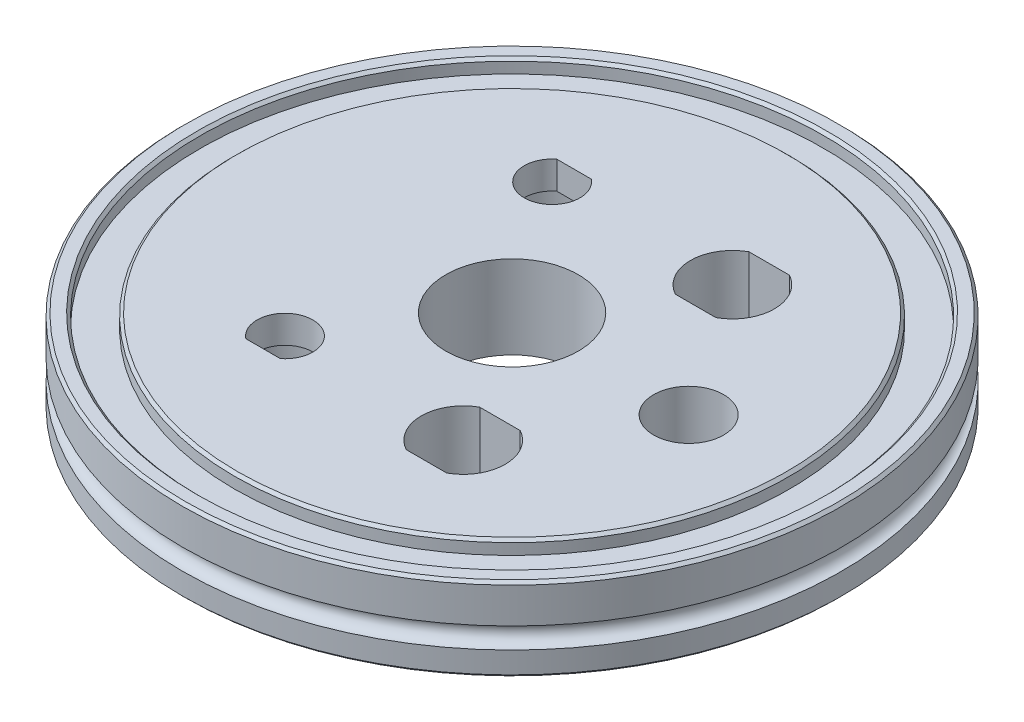
ISO-10303-21;
HEADER;
FILE_DESCRIPTION(('STEP AP214'),'2;1');
FILE_NAME('part.step','',(''),(''),'','','');
FILE_SCHEMA(('AUTOMOTIVE_DESIGN { 1 0 10303 214 1 1 1 1 }'));
ENDSEC;
DATA;
#1=APPLICATION_CONTEXT('core data for automotive mechanical design processes');
#2=APPLICATION_PROTOCOL_DEFINITION('international standard','automotive_design',2000,#1);
#3=PRODUCT_CONTEXT('',#1,'mechanical');
#4=PRODUCT('Part','Part','',(#3));
#5=PRODUCT_RELATED_PRODUCT_CATEGORY('part','',(#4));
#6=PRODUCT_DEFINITION_FORMATION('','',#4);
#7=PRODUCT_DEFINITION_CONTEXT('part definition',#1,'design');
#8=PRODUCT_DEFINITION('design','',#6,#7);
#9=PRODUCT_DEFINITION_SHAPE('','',#8);
#10=(LENGTH_UNIT() NAMED_UNIT(*) SI_UNIT(.MILLI.,.METRE.));
#11=(NAMED_UNIT(*) PLANE_ANGLE_UNIT() SI_UNIT($,.RADIAN.));
#12=(NAMED_UNIT(*) SI_UNIT($,.STERADIAN.) SOLID_ANGLE_UNIT());
#13=UNCERTAINTY_MEASURE_WITH_UNIT(LENGTH_MEASURE(1.E-05),#10,'distance_accuracy_value','');
#14=(GEOMETRIC_REPRESENTATION_CONTEXT(3) GLOBAL_UNCERTAINTY_ASSIGNED_CONTEXT((#13)) GLOBAL_UNIT_ASSIGNED_CONTEXT((#10,
#11,#12)) REPRESENTATION_CONTEXT('',''));
#15=CARTESIAN_POINT('',(0.,0.,0.));
#16=DIRECTION('',(0.,0.,1.));
#17=DIRECTION('',(1.,0.,0.));
#18=AXIS2_PLACEMENT_3D('',#15,#16,#17);
#19=CARTESIAN_POINT('',(-13.4790462542495,0.,-19.2500730407914));
#20=DIRECTION('',(0.,1.,0.));
#21=DIRECTION('',(0.,0.,1.));
#22=AXIS2_PLACEMENT_3D('',#19,#20,#21);
#23=CYLINDRICAL_SURFACE('',#22,4.02);
#24=CARTESIAN_POINT('',(-13.4790462542495,8.,-19.2500730407914));
#25=DIRECTION('',(0.,-1.,0.));
#26=DIRECTION('',(0.,0.,-1.));
#27=AXIS2_PLACEMENT_3D('',#24,#25,#26);
#28=CIRCLE('',#27,4.02);
#29=CARTESIAN_POINT('',(-15.9649234565767,8.,-22.4093157562138));
#30=VERTEX_POINT('',#29);
#31=CARTESIAN_POINT('',(-10.9931690519223,8.,-22.4093157562138));
#32=VERTEX_POINT('',#31);
#33=EDGE_CURVE('E49',#30,#32,#28,.F.);
#34=ORIENTED_EDGE('',*,*,#33,.F.);
#35=DIRECTION('',(0.,1.,0.));
#36=VECTOR('',#35,1.);
#37=CARTESIAN_POINT('',(-15.9649234565767,0.,-22.4093157562138));
#38=LINE('',#37,#36);
#39=CARTESIAN_POINT('',(-15.9649234565767,12.,-22.4093157562138));
#40=VERTEX_POINT('',#39);
#41=EDGE_CURVE('E187',#30,#40,#38,.T.);
#42=ORIENTED_EDGE('',*,*,#41,.T.);
#43=CARTESIAN_POINT('',(-13.4790462542495,12.,-19.2500730407914));
#44=DIRECTION('',(0.,1.,0.));
#45=DIRECTION('',(0.,0.,-1.));
#46=AXIS2_PLACEMENT_3D('',#43,#44,#45);
#47=CIRCLE('',#46,4.02);
#48=CARTESIAN_POINT('',(-10.9931690519223,12.,-22.4093157562138));
#49=VERTEX_POINT('',#48);
#50=EDGE_CURVE('E179',#40,#49,#47,.T.);
#51=ORIENTED_EDGE('',*,*,#50,.T.);
#52=DIRECTION('',(0.,1.,0.));
#53=VECTOR('',#52,1.);
#54=CARTESIAN_POINT('',(-10.9931690519223,0.,-22.4093157562138));
#55=LINE('',#54,#53);
#56=EDGE_CURVE('E186',#32,#49,#55,.T.);
#57=ORIENTED_EDGE('',*,*,#56,.F.);
#58=EDGE_LOOP('',(#34,#42,#51,#57));
#59=FACE_BOUND('',#58,.T.);
#60=ADVANCED_FACE('F36',(#59),#23,.F.);
#61=CARTESIAN_POINT('',(-10.9931690519223,0.,-22.4093157562138));
#62=DIRECTION('',(0.,0.,-1.));
#63=DIRECTION('',(-1.,0.,0.));
#64=AXIS2_PLACEMENT_3D('',#61,#62,#63);
#65=PLANE('',#64);
#66=DIRECTION('',(-1.,0.,0.));
#67=VECTOR('',#66,1.);
#68=CARTESIAN_POINT('',(-10.9931690519223,8.,-22.4093157562138));
#69=LINE('',#68,#67);
#70=EDGE_CURVE('E11',#32,#30,#69,.T.);
#71=ORIENTED_EDGE('',*,*,#70,.F.);
#72=ORIENTED_EDGE('',*,*,#56,.T.);
#73=DIRECTION('',(-1.,0.,0.));
#74=VECTOR('',#73,1.);
#75=CARTESIAN_POINT('',(-10.9931690519223,12.,-22.4093157562138));
#76=LINE('',#75,#74);
#77=EDGE_CURVE('E182',#49,#40,#76,.T.);
#78=ORIENTED_EDGE('',*,*,#77,.T.);
#79=ORIENTED_EDGE('',*,*,#41,.F.);
#80=EDGE_LOOP('',(#71,#72,#78,#79));
#81=FACE_BOUND('',#80,.T.);
#82=ADVANCED_FACE('F248',(#81),#65,.F.);
#83=CARTESIAN_POINT('',(0.,0.400000000000001,0.));
#84=DIRECTION('',(0.,1.,0.));
#85=DIRECTION('',(0.,0.,1.));
#86=AXIS2_PLACEMENT_3D('',#83,#84,#85);
#87=CONICAL_SURFACE('',#86,31.5,0.785398163397394);
#88=CARTESIAN_POINT('',(0.,0.,0.));
#89=DIRECTION('',(0.,1.,0.));
#90=DIRECTION('',(0.,0.,1.));
#91=AXIS2_PLACEMENT_3D('',#88,#89,#90);
#92=CIRCLE('',#91,31.1);
#93=CARTESIAN_POINT('',(0.,0.,31.1));
#94=VERTEX_POINT('',#93);
#95=EDGE_CURVE('E189',#94,#94,#92,.T.);
#96=ORIENTED_EDGE('',*,*,#95,.T.);
#97=EDGE_LOOP('',(#96));
#98=FACE_BOUND('',#97,.T.);
#99=CARTESIAN_POINT('',(0.,0.400000000000001,0.));
#100=DIRECTION('',(0.,1.,0.));
#101=DIRECTION('',(0.,0.,1.));
#102=AXIS2_PLACEMENT_3D('',#99,#100,#101);
#103=CIRCLE('',#102,31.5);
#104=CARTESIAN_POINT('',(0.,0.400000000000001,31.5));
#105=VERTEX_POINT('',#104);
#106=EDGE_CURVE('E125',#105,#105,#103,.T.);
#107=ORIENTED_EDGE('',*,*,#106,.F.);
#108=EDGE_LOOP('',(#107));
#109=FACE_BOUND('',#108,.T.);
#110=ADVANCED_FACE('F38',(#98,#109),#87,.T.);
#111=CARTESIAN_POINT('',(0.,0.,0.));
#112=DIRECTION('',(0.,1.,0.));
#113=DIRECTION('',(0.,0.,1.));
#114=AXIS2_PLACEMENT_3D('',#111,#112,#113);
#115=CYLINDRICAL_SURFACE('',#114,31.5);
#116=ORIENTED_EDGE('',*,*,#106,.T.);
#117=EDGE_LOOP('',(#116));
#118=FACE_BOUND('',#117,.T.);
#119=CARTESIAN_POINT('',(0.,4.5,0.));
#120=DIRECTION('',(0.,1.,0.));
#121=DIRECTION('',(0.,0.,1.));
#122=AXIS2_PLACEMENT_3D('',#119,#120,#121);
#123=CIRCLE('',#122,31.5);
#124=CARTESIAN_POINT('',(0.,4.5,31.5));
#125=VERTEX_POINT('',#124);
#126=EDGE_CURVE('E238',#125,#125,#123,.T.);
#127=ORIENTED_EDGE('',*,*,#126,.F.);
#128=EDGE_LOOP('',(#127));
#129=FACE_BOUND('',#128,.T.);
#130=ADVANCED_FACE('F244',(#118,#129),#115,.T.);
#131=CARTESIAN_POINT('',(35.,4.5,0.));
#132=DIRECTION('',(0.,-1.,0.));
#133=DIRECTION('',(0.,0.,-1.));
#134=AXIS2_PLACEMENT_3D('',#131,#132,#133);
#135=PLANE('',#134);
#136=ORIENTED_EDGE('',*,*,#126,.T.);
#137=EDGE_LOOP('',(#136));
#138=FACE_BOUND('',#137,.T.);
#139=CARTESIAN_POINT('',(0.,4.5,0.));
#140=DIRECTION('',(0.,1.,0.));
#141=DIRECTION('',(0.,0.,1.));
#142=AXIS2_PLACEMENT_3D('',#139,#140,#141);
#143=CIRCLE('',#142,35.);
#144=CARTESIAN_POINT('',(0.,4.5,35.));
#145=VERTEX_POINT('',#144);
#146=EDGE_CURVE('E235',#145,#145,#143,.T.);
#147=ORIENTED_EDGE('',*,*,#146,.F.);
#148=EDGE_LOOP('',(#147));
#149=FACE_BOUND('',#148,.T.);
#150=ADVANCED_FACE('F254',(#138,#149),#135,.T.);
#151=CARTESIAN_POINT('',(0.,0.,0.));
#152=DIRECTION('',(0.,1.,0.));
#153=DIRECTION('',(0.,0.,1.));
#154=AXIS2_PLACEMENT_3D('',#151,#152,#153);
#155=CYLINDRICAL_SURFACE('',#154,35.);
#156=ORIENTED_EDGE('',*,*,#146,.T.);
#157=EDGE_LOOP('',(#156));
#158=FACE_BOUND('',#157,.T.);
#159=CARTESIAN_POINT('',(0.,0.399999999999984,0.));
#160=DIRECTION('',(0.,1.,0.));
#161=DIRECTION('',(0.,0.,1.));
#162=AXIS2_PLACEMENT_3D('',#159,#160,#161);
#163=CIRCLE('',#162,35.);
#164=CARTESIAN_POINT('',(0.,0.399999999999984,35.));
#165=VERTEX_POINT('',#164);
#166=EDGE_CURVE('E232',#165,#165,#163,.T.);
#167=ORIENTED_EDGE('',*,*,#166,.F.);
#168=EDGE_LOOP('',(#167));
#169=FACE_BOUND('',#168,.T.);
#170=ADVANCED_FACE('F324',(#158,#169),#155,.F.);
#171=CARTESIAN_POINT('',(0.,0.,0.));
#172=DIRECTION('',(0.,-1.,0.));
#173=DIRECTION('',(0.,0.,-1.));
#174=AXIS2_PLACEMENT_3D('',#171,#172,#173);
#175=CONICAL_SURFACE('',#174,35.4,0.785398163397448);
#176=ORIENTED_EDGE('',*,*,#166,.T.);
#177=EDGE_LOOP('',(#176));
#178=FACE_BOUND('',#177,.T.);
#179=CARTESIAN_POINT('',(0.,0.,0.));
#180=DIRECTION('',(0.,1.,0.));
#181=DIRECTION('',(0.,0.,1.));
#182=AXIS2_PLACEMENT_3D('',#179,#180,#181);
#183=CIRCLE('',#182,35.4);
#184=CARTESIAN_POINT('',(0.,0.,35.4));
#185=VERTEX_POINT('',#184);
#186=EDGE_CURVE('E229',#185,#185,#183,.T.);
#187=ORIENTED_EDGE('',*,*,#186,.F.);
#188=EDGE_LOOP('',(#187));
#189=FACE_BOUND('',#188,.T.);
#190=ADVANCED_FACE('F320',(#178,#189),#175,.F.);
#191=CARTESIAN_POINT('',(47.1,0.,0.));
#192=DIRECTION('',(0.,-1.,0.));
#193=DIRECTION('',(0.,0.,-1.));
#194=AXIS2_PLACEMENT_3D('',#191,#192,#193);
#195=PLANE('',#194);
#196=ORIENTED_EDGE('',*,*,#186,.T.);
#197=EDGE_LOOP('',(#196));
#198=FACE_BOUND('',#197,.T.);
#199=CARTESIAN_POINT('',(0.,0.,0.));
#200=DIRECTION('',(0.,1.,0.));
#201=DIRECTION('',(0.,0.,1.));
#202=AXIS2_PLACEMENT_3D('',#199,#200,#201);
#203=CIRCLE('',#202,47.1);
#204=CARTESIAN_POINT('',(0.,0.,47.1));
#205=VERTEX_POINT('',#204);
#206=EDGE_CURVE('E226',#205,#205,#203,.T.);
#207=ORIENTED_EDGE('',*,*,#206,.F.);
#208=EDGE_LOOP('',(#207));
#209=FACE_BOUND('',#208,.T.);
#210=ADVANCED_FACE('F316',(#198,#209),#195,.T.);
#211=CARTESIAN_POINT('',(0.,0.400000000000018,0.));
#212=DIRECTION('',(0.,1.,0.));
#213=DIRECTION('',(0.,0.,1.));
#214=AXIS2_PLACEMENT_3D('',#211,#212,#213);
#215=CONICAL_SURFACE('',#214,47.4999999999999,0.785398163397347);
#216=ORIENTED_EDGE('',*,*,#206,.T.);
#217=EDGE_LOOP('',(#216));
#218=FACE_BOUND('',#217,.T.);
#219=CARTESIAN_POINT('',(0.,0.400000000000018,0.));
#220=DIRECTION('',(0.,1.,0.));
#221=DIRECTION('',(0.,0.,1.));
#222=AXIS2_PLACEMENT_3D('',#219,#220,#221);
#223=CIRCLE('',#222,47.4999999999999);
#224=CARTESIAN_POINT('',(0.,0.400000000000018,47.4999999999999));
#225=VERTEX_POINT('',#224);
#226=EDGE_CURVE('E223',#225,#225,#223,.T.);
#227=ORIENTED_EDGE('',*,*,#226,.F.);
#228=EDGE_LOOP('',(#227));
#229=FACE_BOUND('',#228,.T.);
#230=ADVANCED_FACE('F312',(#218,#229),#215,.T.);
#231=CARTESIAN_POINT('',(0.,0.,0.));
#232=DIRECTION('',(0.,1.,0.));
#233=DIRECTION('',(0.,0.,1.));
#234=AXIS2_PLACEMENT_3D('',#231,#232,#233);
#235=CYLINDRICAL_SURFACE('',#234,47.5);
#236=ORIENTED_EDGE('',*,*,#226,.T.);
#237=EDGE_LOOP('',(#236));
#238=FACE_BOUND('',#237,.T.);
#239=CARTESIAN_POINT('',(0.,3.5,0.));
#240=DIRECTION('',(0.,1.,0.));
#241=DIRECTION('',(0.,0.,1.));
#242=AXIS2_PLACEMENT_3D('',#239,#240,#241);
#243=CIRCLE('',#242,47.5);
#244=CARTESIAN_POINT('',(0.,3.5,47.5));
#245=VERTEX_POINT('',#244);
#246=EDGE_CURVE('E220',#245,#245,#243,.T.);
#247=ORIENTED_EDGE('',*,*,#246,.F.);
#248=EDGE_LOOP('',(#247));
#249=FACE_BOUND('',#248,.T.);
#250=ADVANCED_FACE('F308',(#238,#249),#235,.T.);
#251=CARTESIAN_POINT('',(0.,5.,0.));
#252=DIRECTION('',(0.,1.,0.));
#253=DIRECTION('',(0.,0.,1.));
#254=AXIS2_PLACEMENT_3D('',#251,#252,#253);
#255=TOROIDAL_SURFACE('',#254,47.5,1.5);
#256=ORIENTED_EDGE('',*,*,#246,.T.);
#257=EDGE_LOOP('',(#256));
#258=FACE_BOUND('',#257,.T.);
#259=CARTESIAN_POINT('',(0.,6.5,0.));
#260=DIRECTION('',(0.,1.,0.));
#261=DIRECTION('',(0.,0.,1.));
#262=AXIS2_PLACEMENT_3D('',#259,#260,#261);
#263=CIRCLE('',#262,47.5);
#264=CARTESIAN_POINT('',(0.,6.5,47.5));
#265=VERTEX_POINT('',#264);
#266=EDGE_CURVE('E217',#265,#265,#263,.T.);
#267=ORIENTED_EDGE('',*,*,#266,.F.);
#268=EDGE_LOOP('',(#267));
#269=FACE_BOUND('',#268,.T.);
#270=ADVANCED_FACE('F304',(#258,#269),#255,.F.);
#271=CARTESIAN_POINT('',(0.,0.,0.));
#272=DIRECTION('',(0.,1.,0.));
#273=DIRECTION('',(0.,0.,1.));
#274=AXIS2_PLACEMENT_3D('',#271,#272,#273);
#275=CYLINDRICAL_SURFACE('',#274,47.5);
#276=ORIENTED_EDGE('',*,*,#266,.T.);
#277=EDGE_LOOP('',(#276));
#278=FACE_BOUND('',#277,.T.);
#279=CARTESIAN_POINT('',(0.,11.6,0.));
#280=DIRECTION('',(0.,1.,0.));
#281=DIRECTION('',(0.,0.,1.));
#282=AXIS2_PLACEMENT_3D('',#279,#280,#281);
#283=CIRCLE('',#282,47.5);
#284=CARTESIAN_POINT('',(0.,11.6,47.5));
#285=VERTEX_POINT('',#284);
#286=EDGE_CURVE('E214',#285,#285,#283,.T.);
#287=ORIENTED_EDGE('',*,*,#286,.F.);
#288=EDGE_LOOP('',(#287));
#289=FACE_BOUND('',#288,.T.);
#290=ADVANCED_FACE('F300',(#278,#289),#275,.T.);
#291=CARTESIAN_POINT('',(0.,12.,0.));
#292=DIRECTION('',(0.,-1.,0.));
#293=DIRECTION('',(0.,0.,-1.));
#294=AXIS2_PLACEMENT_3D('',#291,#292,#293);
#295=CONICAL_SURFACE('',#294,47.1,0.78539816339744);
#296=ORIENTED_EDGE('',*,*,#286,.T.);
#297=EDGE_LOOP('',(#296));
#298=FACE_BOUND('',#297,.T.);
#299=CARTESIAN_POINT('',(0.,12.,0.));
#300=DIRECTION('',(0.,1.,0.));
#301=DIRECTION('',(0.,0.,1.));
#302=AXIS2_PLACEMENT_3D('',#299,#300,#301);
#303=CIRCLE('',#302,47.1);
#304=CARTESIAN_POINT('',(0.,12.,47.1));
#305=VERTEX_POINT('',#304);
#306=EDGE_CURVE('E211',#305,#305,#303,.T.);
#307=ORIENTED_EDGE('',*,*,#306,.F.);
#308=EDGE_LOOP('',(#307));
#309=FACE_BOUND('',#308,.T.);
#310=ADVANCED_FACE('F296',(#298,#309),#295,.T.);
#311=CARTESIAN_POINT('',(45.4,12.,0.));
#312=DIRECTION('',(0.,1.,0.));
#313=DIRECTION('',(0.,0.,1.));
#314=AXIS2_PLACEMENT_3D('',#311,#312,#313);
#315=PLANE('',#314);
#316=ORIENTED_EDGE('',*,*,#306,.T.);
#317=EDGE_LOOP('',(#316));
#318=FACE_BOUND('',#317,.T.);
#319=CARTESIAN_POINT('',(0.,12.,0.));
#320=DIRECTION('',(0.,1.,0.));
#321=DIRECTION('',(0.,0.,1.));
#322=AXIS2_PLACEMENT_3D('',#319,#320,#321);
#323=CIRCLE('',#322,45.4);
#324=CARTESIAN_POINT('',(0.,12.,45.4));
#325=VERTEX_POINT('',#324);
#326=EDGE_CURVE('E208',#325,#325,#323,.T.);
#327=ORIENTED_EDGE('',*,*,#326,.F.);
#328=EDGE_LOOP('',(#327));
#329=FACE_BOUND('',#328,.T.);
#330=ADVANCED_FACE('F292',(#318,#329),#315,.T.);
#331=CARTESIAN_POINT('',(0.,11.6,0.));
#332=DIRECTION('',(0.,1.,0.));
#333=DIRECTION('',(0.,0.,1.));
#334=AXIS2_PLACEMENT_3D('',#331,#332,#333);
#335=CONICAL_SURFACE('',#334,45.,0.785398163397461);
#336=ORIENTED_EDGE('',*,*,#326,.T.);
#337=EDGE_LOOP('',(#336));
#338=FACE_BOUND('',#337,.T.);
#339=CARTESIAN_POINT('',(0.,11.6,0.));
#340=DIRECTION('',(0.,1.,0.));
#341=DIRECTION('',(0.,0.,1.));
#342=AXIS2_PLACEMENT_3D('',#339,#340,#341);
#343=CIRCLE('',#342,45.);
#344=CARTESIAN_POINT('',(0.,11.6,45.));
#345=VERTEX_POINT('',#344);
#346=EDGE_CURVE('E205',#345,#345,#343,.T.);
#347=ORIENTED_EDGE('',*,*,#346,.F.);
#348=EDGE_LOOP('',(#347));
#349=FACE_BOUND('',#348,.T.);
#350=ADVANCED_FACE('F288',(#338,#349),#335,.F.);
#351=CARTESIAN_POINT('',(0.,0.,0.));
#352=DIRECTION('',(0.,1.,0.));
#353=DIRECTION('',(0.,0.,1.));
#354=AXIS2_PLACEMENT_3D('',#351,#352,#353);
#355=CYLINDRICAL_SURFACE('',#354,45.);
#356=ORIENTED_EDGE('',*,*,#346,.T.);
#357=EDGE_LOOP('',(#356));
#358=FACE_BOUND('',#357,.T.);
#359=CARTESIAN_POINT('',(0.,10.,0.));
#360=DIRECTION('',(0.,1.,0.));
#361=DIRECTION('',(0.,0.,1.));
#362=AXIS2_PLACEMENT_3D('',#359,#360,#361);
#363=CIRCLE('',#362,45.);
#364=CARTESIAN_POINT('',(0.,10.,45.));
#365=VERTEX_POINT('',#364);
#366=EDGE_CURVE('E202',#365,#365,#363,.T.);
#367=ORIENTED_EDGE('',*,*,#366,.F.);
#368=EDGE_LOOP('',(#367));
#369=FACE_BOUND('',#368,.T.);
#370=ADVANCED_FACE('F284',(#358,#369),#355,.F.);
#371=CARTESIAN_POINT('',(40.,10.,0.));
#372=DIRECTION('',(0.,1.,0.));
#373=DIRECTION('',(0.,0.,1.));
#374=AXIS2_PLACEMENT_3D('',#371,#372,#373);
#375=PLANE('',#374);
#376=ORIENTED_EDGE('',*,*,#366,.T.);
#377=EDGE_LOOP('',(#376));
#378=FACE_BOUND('',#377,.T.);
#379=CARTESIAN_POINT('',(0.,10.,0.));
#380=DIRECTION('',(0.,1.,0.));
#381=DIRECTION('',(0.,0.,1.));
#382=AXIS2_PLACEMENT_3D('',#379,#380,#381);
#383=CIRCLE('',#382,40.);
#384=CARTESIAN_POINT('',(0.,10.,40.));
#385=VERTEX_POINT('',#384);
#386=EDGE_CURVE('E199',#385,#385,#383,.T.);
#387=ORIENTED_EDGE('',*,*,#386,.F.);
#388=EDGE_LOOP('',(#387));
#389=FACE_BOUND('',#388,.T.);
#390=ADVANCED_FACE('F280',(#378,#389),#375,.T.);
#391=CARTESIAN_POINT('',(0.,0.,0.));
#392=DIRECTION('',(0.,1.,0.));
#393=DIRECTION('',(0.,0.,1.));
#394=AXIS2_PLACEMENT_3D('',#391,#392,#393);
#395=CYLINDRICAL_SURFACE('',#394,40.);
#396=ORIENTED_EDGE('',*,*,#386,.T.);
#397=EDGE_LOOP('',(#396));
#398=FACE_BOUND('',#397,.T.);
#399=CARTESIAN_POINT('',(0.,11.6,0.));
#400=DIRECTION('',(0.,1.,0.));
#401=DIRECTION('',(0.,0.,1.));
#402=AXIS2_PLACEMENT_3D('',#399,#400,#401);
#403=CIRCLE('',#402,40.);
#404=CARTESIAN_POINT('',(0.,11.6,40.));
#405=VERTEX_POINT('',#404);
#406=EDGE_CURVE('E196',#405,#405,#403,.T.);
#407=ORIENTED_EDGE('',*,*,#406,.F.);
#408=EDGE_LOOP('',(#407));
#409=FACE_BOUND('',#408,.T.);
#410=ADVANCED_FACE('F276',(#398,#409),#395,.T.);
#411=CARTESIAN_POINT('',(0.,12.,0.));
#412=DIRECTION('',(0.,-1.,0.));
#413=DIRECTION('',(0.,0.,-1.));
#414=AXIS2_PLACEMENT_3D('',#411,#412,#413);
#415=CONICAL_SURFACE('',#414,39.6,0.78539816339744);
#416=ORIENTED_EDGE('',*,*,#406,.T.);
#417=EDGE_LOOP('',(#416));
#418=FACE_BOUND('',#417,.T.);
#419=CARTESIAN_POINT('',(0.,12.,0.));
#420=DIRECTION('',(0.,1.,0.));
#421=DIRECTION('',(0.,0.,1.));
#422=AXIS2_PLACEMENT_3D('',#419,#420,#421);
#423=CIRCLE('',#422,39.6);
#424=CARTESIAN_POINT('',(0.,12.,39.6));
#425=VERTEX_POINT('',#424);
#426=EDGE_CURVE('E193',#425,#425,#423,.T.);
#427=ORIENTED_EDGE('',*,*,#426,.F.);
#428=EDGE_LOOP('',(#427));
#429=FACE_BOUND('',#428,.T.);
#430=ADVANCED_FACE('F272',(#418,#429),#415,.T.);
#431=CARTESIAN_POINT('',(0.,12.,0.));
#432=DIRECTION('',(0.,1.,0.));
#433=DIRECTION('',(0.,0.,1.));
#434=AXIS2_PLACEMENT_3D('',#431,#432,#433);
#435=PLANE('',#434);
#436=CARTESIAN_POINT('',(0.,12.,0.));
#437=DIRECTION('',(0.,1.,0.));
#438=DIRECTION('',(0.,0.,1.));
#439=AXIS2_PLACEMENT_3D('',#436,#437,#438);
#440=CIRCLE('',#439,9.55);
#441=CARTESIAN_POINT('',(0.,12.,9.55));
#442=VERTEX_POINT('',#441);
#443=EDGE_CURVE('E644',#442,#442,#440,.T.);
#444=ORIENTED_EDGE('',*,*,#443,.F.);
#445=EDGE_LOOP('',(#444));
#446=FACE_BOUND('',#445,.T.);
#447=CARTESIAN_POINT('',(12.3578909919768,12.,19.3980032536965));
#448=DIRECTION('',(0.,1.,0.));
#449=DIRECTION('',(0.,0.,-1.));
#450=AXIS2_PLACEMENT_3D('',#447,#448,#449);
#451=CIRCLE('',#450,6.05000000000002);
#452=CARTESIAN_POINT('',(9.44027209979774,12.,14.0980032536965));
#453=VERTEX_POINT('',#452);
#454=CARTESIAN_POINT('',(9.44027209979776,12.,24.6980032536965));
#455=VERTEX_POINT('',#454);
#456=EDGE_CURVE('E160',#453,#455,#451,.T.);
#457=ORIENTED_EDGE('',*,*,#456,.F.);
#458=DIRECTION('',(-1.,0.,0.));
#459=VECTOR('',#458,1.);
#460=CARTESIAN_POINT('',(9.44027209979774,12.,14.0980032536965));
#461=LINE('',#460,#459);
#462=CARTESIAN_POINT('',(15.2755098841559,12.,14.0980032536965));
#463=VERTEX_POINT('',#462);
#464=EDGE_CURVE('E150',#463,#453,#461,.T.);
#465=ORIENTED_EDGE('',*,*,#464,.F.);
#466=CARTESIAN_POINT('',(12.3578909919768,12.,19.3980032536965));
#467=DIRECTION('',(0.,1.,0.));
#468=DIRECTION('',(0.,0.,-1.));
#469=AXIS2_PLACEMENT_3D('',#466,#467,#468);
#470=CIRCLE('',#469,6.04999999999999);
#471=CARTESIAN_POINT('',(15.2755098841559,12.,24.6980032536964));
#472=VERTEX_POINT('',#471);
#473=EDGE_CURVE('E165',#472,#463,#470,.T.);
#474=ORIENTED_EDGE('',*,*,#473,.F.);
#475=DIRECTION('',(1.,0.,0.));
#476=VECTOR('',#475,1.);
#477=CARTESIAN_POINT('',(9.44027209979776,12.,24.6980032536965));
#478=LINE('',#477,#476);
#479=EDGE_CURVE('E162',#455,#472,#478,.T.);
#480=ORIENTED_EDGE('',*,*,#479,.F.);
#481=EDGE_LOOP('',(#457,#465,#474,#480));
#482=FACE_BOUND('',#481,.T.);
#483=CARTESIAN_POINT('',(-13.4790462542495,12.,19.2500730407914));
#484=DIRECTION('',(0.,1.,0.));
#485=DIRECTION('',(0.,0.,1.));
#486=AXIS2_PLACEMENT_3D('',#483,#484,#485);
#487=CIRCLE('',#486,4.02);
#488=CARTESIAN_POINT('',(-10.9931690519223,12.,22.4093157562138));
#489=VERTEX_POINT('',#488);
#490=CARTESIAN_POINT('',(-15.9649234565767,12.,22.4093157562138));
#491=VERTEX_POINT('',#490);
#492=EDGE_CURVE('E172',#489,#491,#487,.T.);
#493=ORIENTED_EDGE('',*,*,#492,.F.);
#494=DIRECTION('',(1.,0.,0.));
#495=VECTOR('',#494,1.);
#496=CARTESIAN_POINT('',(-10.9931690519223,12.,22.4093157562138));
#497=LINE('',#496,#495);
#498=EDGE_CURVE('E136',#491,#489,#497,.T.);
#499=ORIENTED_EDGE('',*,*,#498,.F.);
#500=EDGE_LOOP('',(#493,#499));
#501=FACE_BOUND('',#500,.T.);
#502=CARTESIAN_POINT('',(12.3578909919768,12.,-19.3980032536965));
#503=DIRECTION('',(0.,1.,0.));
#504=DIRECTION('',(0.,0.,1.));
#505=AXIS2_PLACEMENT_3D('',#502,#503,#504);
#506=CIRCLE('',#505,6.05000000000002);
#507=CARTESIAN_POINT('',(9.44027209979776,12.,-24.6980032536965));
#508=VERTEX_POINT('',#507);
#509=CARTESIAN_POINT('',(9.44027209979774,12.,-14.0980032536965));
#510=VERTEX_POINT('',#509);
#511=EDGE_CURVE('E138',#508,#510,#506,.T.);
#512=ORIENTED_EDGE('',*,*,#511,.F.);
#513=DIRECTION('',(-1.,0.,0.));
#514=VECTOR('',#513,1.);
#515=CARTESIAN_POINT('',(9.44027209979776,12.,-24.6980032536965));
#516=LINE('',#515,#514);
#517=CARTESIAN_POINT('',(15.2755098841559,12.,-24.6980032536964));
#518=VERTEX_POINT('',#517);
#519=EDGE_CURVE('E670',#518,#508,#516,.T.);
#520=ORIENTED_EDGE('',*,*,#519,.F.);
#521=CARTESIAN_POINT('',(12.3578909919768,12.,-19.3980032536965));
#522=DIRECTION('',(0.,1.,0.));
#523=DIRECTION('',(0.,0.,1.));
#524=AXIS2_PLACEMENT_3D('',#521,#522,#523);
#525=CIRCLE('',#524,6.04999999999999);
#526=CARTESIAN_POINT('',(15.2755098841559,12.,-14.0980032536965));
#527=VERTEX_POINT('',#526);
#528=EDGE_CURVE('E682',#527,#518,#525,.T.);
#529=ORIENTED_EDGE('',*,*,#528,.F.);
#530=DIRECTION('',(1.,0.,0.));
#531=VECTOR('',#530,1.);
#532=CARTESIAN_POINT('',(9.44027209979774,12.,-14.0980032536965));
#533=LINE('',#532,#531);
#534=EDGE_CURVE('E140',#510,#527,#533,.T.);
#535=ORIENTED_EDGE('',*,*,#534,.F.);
#536=EDGE_LOOP('',(#512,#520,#529,#535));
#537=FACE_BOUND('',#536,.T.);
#538=CARTESIAN_POINT('',(25.45,12.,0.));
#539=DIRECTION('',(0.,1.,0.));
#540=DIRECTION('',(0.,0.,1.));
#541=AXIS2_PLACEMENT_3D('',#538,#539,#540);
#542=CIRCLE('',#541,5.05);
#543=CARTESIAN_POINT('',(25.45,12.,5.05));
#544=VERTEX_POINT('',#543);
#545=EDGE_CURVE('E662',#544,#544,#542,.T.);
#546=ORIENTED_EDGE('',*,*,#545,.F.);
#547=EDGE_LOOP('',(#546));
#548=FACE_BOUND('',#547,.T.);
#549=ORIENTED_EDGE('',*,*,#50,.F.);
#550=ORIENTED_EDGE('',*,*,#77,.F.);
#551=EDGE_LOOP('',(#549,#550));
#552=FACE_BOUND('',#551,.T.);
#553=ORIENTED_EDGE('',*,*,#426,.T.);
#554=EDGE_LOOP('',(#553));
#555=FACE_BOUND('',#554,.T.);
#556=ADVANCED_FACE('F268',(#446,#482,#501,#537,#548,#552,#555),#435,.T.);
#557=CARTESIAN_POINT('',(31.1,0.,0.));
#558=DIRECTION('',(0.,-1.,0.));
#559=DIRECTION('',(0.,0.,-1.));
#560=AXIS2_PLACEMENT_3D('',#557,#558,#559);
#561=PLANE('',#560);
#562=CARTESIAN_POINT('',(0.,0.,0.));
#563=DIRECTION('',(0.,1.,0.));
#564=DIRECTION('',(0.,0.,1.));
#565=AXIS2_PLACEMENT_3D('',#562,#563,#564);
#566=CIRCLE('',#565,9.55);
#567=CARTESIAN_POINT('',(0.,0.,9.55));
#568=VERTEX_POINT('',#567);
#569=EDGE_CURVE('E641',#568,#568,#566,.T.);
#570=ORIENTED_EDGE('',*,*,#569,.T.);
#571=EDGE_LOOP('',(#570));
#572=FACE_BOUND('',#571,.T.);
#573=CARTESIAN_POINT('',(-13.4790462542495,0.,-19.2500730407914));
#574=DIRECTION('',(0.,-1.,0.));
#575=DIRECTION('',(0.,0.,-1.));
#576=AXIS2_PLACEMENT_3D('',#573,#574,#575);
#577=CIRCLE('',#576,6.95);
#578=CARTESIAN_POINT('',(-13.4790462542495,0.,-26.2000730407914));
#579=VERTEX_POINT('',#578);
#580=EDGE_CURVE('E651',#579,#579,#577,.T.);
#581=ORIENTED_EDGE('',*,*,#580,.F.);
#582=EDGE_LOOP('',(#581));
#583=FACE_BOUND('',#582,.T.);
#584=CARTESIAN_POINT('',(-13.4790462542495,0.,19.2500730407914));
#585=DIRECTION('',(0.,-1.,0.));
#586=DIRECTION('',(0.,0.,1.));
#587=AXIS2_PLACEMENT_3D('',#584,#585,#586);
#588=CIRCLE('',#587,6.95);
#589=CARTESIAN_POINT('',(-13.4790462542495,0.,26.2000730407914));
#590=VERTEX_POINT('',#589);
#591=EDGE_CURVE('E646',#590,#590,#588,.T.);
#592=ORIENTED_EDGE('',*,*,#591,.F.);
#593=EDGE_LOOP('',(#592));
#594=FACE_BOUND('',#593,.T.);
#595=CARTESIAN_POINT('',(12.3578909919768,0.,19.3980032536965));
#596=DIRECTION('',(0.,1.,0.));
#597=DIRECTION('',(0.,0.,-1.));
#598=AXIS2_PLACEMENT_3D('',#595,#596,#597);
#599=CIRCLE('',#598,6.05000000000002);
#600=CARTESIAN_POINT('',(9.44027209979774,0.,14.0980032536965));
#601=VERTEX_POINT('',#600);
#602=CARTESIAN_POINT('',(9.44027209979776,0.,24.6980032536965));
#603=VERTEX_POINT('',#602);
#604=EDGE_CURVE('E146',#601,#603,#599,.T.);
#605=ORIENTED_EDGE('',*,*,#604,.T.);
#606=DIRECTION('',(1.,0.,0.));
#607=VECTOR('',#606,1.);
#608=CARTESIAN_POINT('',(9.44027209979776,0.,24.6980032536965));
#609=LINE('',#608,#607);
#610=CARTESIAN_POINT('',(15.2755098841559,0.,24.6980032536964));
#611=VERTEX_POINT('',#610);
#612=EDGE_CURVE('E149',#603,#611,#609,.T.);
#613=ORIENTED_EDGE('',*,*,#612,.T.);
#614=CARTESIAN_POINT('',(12.3578909919768,0.,19.3980032536965));
#615=DIRECTION('',(0.,1.,0.));
#616=DIRECTION('',(0.,0.,-1.));
#617=AXIS2_PLACEMENT_3D('',#614,#615,#616);
#618=CIRCLE('',#617,6.04999999999999);
#619=CARTESIAN_POINT('',(15.2755098841559,0.,14.0980032536965));
#620=VERTEX_POINT('',#619);
#621=EDGE_CURVE('E153',#611,#620,#618,.T.);
#622=ORIENTED_EDGE('',*,*,#621,.T.);
#623=DIRECTION('',(-1.,0.,0.));
#624=VECTOR('',#623,1.);
#625=CARTESIAN_POINT('',(9.44027209979774,0.,14.0980032536965));
#626=LINE('',#625,#624);
#627=EDGE_CURVE('E156',#620,#601,#626,.T.);
#628=ORIENTED_EDGE('',*,*,#627,.T.);
#629=EDGE_LOOP('',(#605,#613,#622,#628));
#630=FACE_BOUND('',#629,.T.);
#631=CARTESIAN_POINT('',(12.3578909919768,0.,-19.3980032536965));
#632=DIRECTION('',(0.,1.,0.));
#633=DIRECTION('',(0.,0.,1.));
#634=AXIS2_PLACEMENT_3D('',#631,#632,#633);
#635=CIRCLE('',#634,6.05000000000002);
#636=CARTESIAN_POINT('',(9.44027209979776,0.,-24.6980032536965));
#637=VERTEX_POINT('',#636);
#638=CARTESIAN_POINT('',(9.44027209979774,0.,-14.0980032536965));
#639=VERTEX_POINT('',#638);
#640=EDGE_CURVE('E666',#637,#639,#635,.T.);
#641=ORIENTED_EDGE('',*,*,#640,.T.);
#642=DIRECTION('',(1.,0.,0.));
#643=VECTOR('',#642,1.);
#644=CARTESIAN_POINT('',(9.44027209979774,0.,-14.0980032536965));
#645=LINE('',#644,#643);
#646=CARTESIAN_POINT('',(15.2755098841559,0.,-14.0980032536965));
#647=VERTEX_POINT('',#646);
#648=EDGE_CURVE('E669',#639,#647,#645,.T.);
#649=ORIENTED_EDGE('',*,*,#648,.T.);
#650=CARTESIAN_POINT('',(12.3578909919768,0.,-19.3980032536965));
#651=DIRECTION('',(0.,1.,0.));
#652=DIRECTION('',(0.,0.,1.));
#653=AXIS2_PLACEMENT_3D('',#650,#651,#652);
#654=CIRCLE('',#653,6.04999999999999);
#655=CARTESIAN_POINT('',(15.2755098841559,0.,-24.6980032536964));
#656=VERTEX_POINT('',#655);
#657=EDGE_CURVE('E673',#647,#656,#654,.T.);
#658=ORIENTED_EDGE('',*,*,#657,.T.);
#659=DIRECTION('',(-1.,0.,0.));
#660=VECTOR('',#659,1.);
#661=CARTESIAN_POINT('',(9.44027209979776,0.,-24.6980032536965));
#662=LINE('',#661,#660);
#663=EDGE_CURVE('E676',#656,#637,#662,.T.);
#664=ORIENTED_EDGE('',*,*,#663,.T.);
#665=EDGE_LOOP('',(#641,#649,#658,#664));
#666=FACE_BOUND('',#665,.T.);
#667=CARTESIAN_POINT('',(25.45,0.,0.));
#668=DIRECTION('',(0.,1.,0.));
#669=DIRECTION('',(0.,0.,1.));
#670=AXIS2_PLACEMENT_3D('',#667,#668,#669);
#671=CIRCLE('',#670,5.05);
#672=CARTESIAN_POINT('',(25.45,0.,5.05));
#673=VERTEX_POINT('',#672);
#674=EDGE_CURVE('E183',#673,#673,#671,.T.);
#675=ORIENTED_EDGE('',*,*,#674,.T.);
#676=EDGE_LOOP('',(#675));
#677=FACE_BOUND('',#676,.T.);
#678=ORIENTED_EDGE('',*,*,#95,.F.);
#679=EDGE_LOOP('',(#678));
#680=FACE_BOUND('',#679,.T.);
#681=ADVANCED_FACE('F264',(#572,#583,#594,#630,#666,#677,#680),#561,.T.);
#682=CARTESIAN_POINT('',(25.45,0.,0.));
#683=DIRECTION('',(0.,1.,0.));
#684=DIRECTION('',(0.,0.,1.));
#685=AXIS2_PLACEMENT_3D('',#682,#683,#684);
#686=CYLINDRICAL_SURFACE('',#685,5.05);
#687=ORIENTED_EDGE('',*,*,#674,.F.);
#688=EDGE_LOOP('',(#687));
#689=FACE_BOUND('',#688,.T.);
#690=ORIENTED_EDGE('',*,*,#545,.T.);
#691=EDGE_LOOP('',(#690));
#692=FACE_BOUND('',#691,.T.);
#693=ADVANCED_FACE('F267',(#689,#692),#686,.F.);
#694=CARTESIAN_POINT('',(12.3578909919768,0.,-19.3980032536965));
#695=DIRECTION('',(0.,1.,0.));
#696=DIRECTION('',(0.,0.,1.));
#697=AXIS2_PLACEMENT_3D('',#694,#695,#696);
#698=CYLINDRICAL_SURFACE('',#697,6.05000000000002);
#699=ORIENTED_EDGE('',*,*,#511,.T.);
#700=DIRECTION('',(0.,1.,0.));
#701=VECTOR('',#700,1.);
#702=CARTESIAN_POINT('',(9.44027209979774,0.,-14.0980032536965));
#703=LINE('',#702,#701);
#704=EDGE_CURVE('E678',#639,#510,#703,.T.);
#705=ORIENTED_EDGE('',*,*,#704,.F.);
#706=ORIENTED_EDGE('',*,*,#640,.F.);
#707=DIRECTION('',(0.,1.,0.));
#708=VECTOR('',#707,1.);
#709=CARTESIAN_POINT('',(9.44027209979776,0.,-24.6980032536965));
#710=LINE('',#709,#708);
#711=EDGE_CURVE('E665',#637,#508,#710,.T.);
#712=ORIENTED_EDGE('',*,*,#711,.T.);
#713=EDGE_LOOP('',(#699,#705,#706,#712));
#714=FACE_BOUND('',#713,.T.);
#715=ADVANCED_FACE('F439',(#714),#698,.F.);
#716=CARTESIAN_POINT('',(9.44027209979776,0.,-24.6980032536965));
#717=DIRECTION('',(0.,0.,-1.));
#718=DIRECTION('',(-1.,0.,0.));
#719=AXIS2_PLACEMENT_3D('',#716,#717,#718);
#720=PLANE('',#719);
#721=ORIENTED_EDGE('',*,*,#519,.T.);
#722=ORIENTED_EDGE('',*,*,#711,.F.);
#723=ORIENTED_EDGE('',*,*,#663,.F.);
#724=DIRECTION('',(0.,1.,0.));
#725=VECTOR('',#724,1.);
#726=CARTESIAN_POINT('',(15.2755098841559,0.,-24.6980032536964));
#727=LINE('',#726,#725);
#728=EDGE_CURVE('E688',#656,#518,#727,.T.);
#729=ORIENTED_EDGE('',*,*,#728,.T.);
#730=EDGE_LOOP('',(#721,#722,#723,#729));
#731=FACE_BOUND('',#730,.T.);
#732=ADVANCED_FACE('F447',(#731),#720,.F.);
#733=CARTESIAN_POINT('',(12.3578909919768,0.,-19.3980032536965));
#734=DIRECTION('',(0.,1.,0.));
#735=DIRECTION('',(0.,0.,1.));
#736=AXIS2_PLACEMENT_3D('',#733,#734,#735);
#737=CYLINDRICAL_SURFACE('',#736,6.04999999999999);
#738=ORIENTED_EDGE('',*,*,#528,.T.);
#739=ORIENTED_EDGE('',*,*,#728,.F.);
#740=ORIENTED_EDGE('',*,*,#657,.F.);
#741=DIRECTION('',(0.,1.,0.));
#742=VECTOR('',#741,1.);
#743=CARTESIAN_POINT('',(15.2755098841559,0.,-14.0980032536965));
#744=LINE('',#743,#742);
#745=EDGE_CURVE('E690',#647,#527,#744,.T.);
#746=ORIENTED_EDGE('',*,*,#745,.T.);
#747=EDGE_LOOP('',(#738,#739,#740,#746));
#748=FACE_BOUND('',#747,.T.);
#749=ADVANCED_FACE('F455',(#748),#737,.F.);
#750=CARTESIAN_POINT('',(9.44027209979774,0.,-14.0980032536965));
#751=DIRECTION('',(0.,0.,1.));
#752=DIRECTION('',(1.,0.,0.));
#753=AXIS2_PLACEMENT_3D('',#750,#751,#752);
#754=PLANE('',#753);
#755=ORIENTED_EDGE('',*,*,#534,.T.);
#756=ORIENTED_EDGE('',*,*,#745,.F.);
#757=ORIENTED_EDGE('',*,*,#648,.F.);
#758=ORIENTED_EDGE('',*,*,#704,.T.);
#759=EDGE_LOOP('',(#755,#756,#757,#758));
#760=FACE_BOUND('',#759,.T.);
#761=ADVANCED_FACE('F463',(#760),#754,.F.);
#762=CARTESIAN_POINT('',(-13.4790462542495,0.,19.2500730407914));
#763=DIRECTION('',(0.,1.,0.));
#764=DIRECTION('',(0.,0.,1.));
#765=AXIS2_PLACEMENT_3D('',#762,#763,#764);
#766=CYLINDRICAL_SURFACE('',#765,4.02);
#767=DIRECTION('',(0.,1.,0.));
#768=VECTOR('',#767,1.);
#769=CARTESIAN_POINT('',(-15.9649234565767,0.,22.4093157562138));
#770=LINE('',#769,#768);
#771=CARTESIAN_POINT('',(-15.9649234565767,8.,22.4093157562138));
#772=VERTEX_POINT('',#771);
#773=EDGE_CURVE('E131',#772,#491,#770,.T.);
#774=ORIENTED_EDGE('',*,*,#773,.F.);
#775=CARTESIAN_POINT('',(-13.4790462542495,8.,19.2500730407914));
#776=DIRECTION('',(0.,1.,0.));
#777=DIRECTION('',(0.,0.,1.));
#778=AXIS2_PLACEMENT_3D('',#775,#776,#777);
#779=CIRCLE('',#778,4.02);
#780=CARTESIAN_POINT('',(-10.9931690519223,8.,22.4093157562138));
#781=VERTEX_POINT('',#780);
#782=EDGE_CURVE('E56',#772,#781,#779,.F.);
#783=ORIENTED_EDGE('',*,*,#782,.T.);
#784=DIRECTION('',(0.,1.,0.));
#785=VECTOR('',#784,1.);
#786=CARTESIAN_POINT('',(-10.9931690519223,0.,22.4093157562138));
#787=LINE('',#786,#785);
#788=EDGE_CURVE('E129',#781,#489,#787,.T.);
#789=ORIENTED_EDGE('',*,*,#788,.T.);
#790=ORIENTED_EDGE('',*,*,#492,.T.);
#791=EDGE_LOOP('',(#774,#783,#789,#790));
#792=FACE_BOUND('',#791,.T.);
#793=ADVANCED_FACE('F127',(#792),#766,.F.);
#794=CARTESIAN_POINT('',(-10.9931690519223,0.,22.4093157562138));
#795=DIRECTION('',(0.,0.,1.));
#796=DIRECTION('',(1.,0.,0.));
#797=AXIS2_PLACEMENT_3D('',#794,#795,#796);
#798=PLANE('',#797);
#799=ORIENTED_EDGE('',*,*,#788,.F.);
#800=DIRECTION('',(-1.,0.,0.));
#801=VECTOR('',#800,1.);
#802=CARTESIAN_POINT('',(-10.9931690519223,8.,22.4093157562138));
#803=LINE('',#802,#801);
#804=EDGE_CURVE('E44',#781,#772,#803,.T.);
#805=ORIENTED_EDGE('',*,*,#804,.T.);
#806=ORIENTED_EDGE('',*,*,#773,.T.);
#807=ORIENTED_EDGE('',*,*,#498,.T.);
#808=EDGE_LOOP('',(#799,#805,#806,#807));
#809=FACE_BOUND('',#808,.T.);
#810=ADVANCED_FACE('F134',(#809),#798,.F.);
#811=CARTESIAN_POINT('',(12.3578909919768,0.,19.3980032536965));
#812=DIRECTION('',(0.,1.,0.));
#813=DIRECTION('',(0.,0.,1.));
#814=AXIS2_PLACEMENT_3D('',#811,#812,#813);
#815=CYLINDRICAL_SURFACE('',#814,6.05000000000002);
#816=ORIENTED_EDGE('',*,*,#456,.T.);
#817=DIRECTION('',(0.,1.,0.));
#818=VECTOR('',#817,1.);
#819=CARTESIAN_POINT('',(9.44027209979776,0.,24.6980032536965));
#820=LINE('',#819,#818);
#821=EDGE_CURVE('E159',#603,#455,#820,.T.);
#822=ORIENTED_EDGE('',*,*,#821,.F.);
#823=ORIENTED_EDGE('',*,*,#604,.F.);
#824=DIRECTION('',(0.,1.,0.));
#825=VECTOR('',#824,1.);
#826=CARTESIAN_POINT('',(9.44027209979774,0.,14.0980032536965));
#827=LINE('',#826,#825);
#828=EDGE_CURVE('E170',#601,#453,#827,.T.);
#829=ORIENTED_EDGE('',*,*,#828,.T.);
#830=EDGE_LOOP('',(#816,#822,#823,#829));
#831=FACE_BOUND('',#830,.T.);
#832=ADVANCED_FACE('F486',(#831),#815,.F.);
#833=CARTESIAN_POINT('',(9.44027209979774,0.,14.0980032536965));
#834=DIRECTION('',(0.,0.,-1.));
#835=DIRECTION('',(-1.,0.,0.));
#836=AXIS2_PLACEMENT_3D('',#833,#834,#835);
#837=PLANE('',#836);
#838=ORIENTED_EDGE('',*,*,#464,.T.);
#839=ORIENTED_EDGE('',*,*,#828,.F.);
#840=ORIENTED_EDGE('',*,*,#627,.F.);
#841=DIRECTION('',(0.,1.,0.));
#842=VECTOR('',#841,1.);
#843=CARTESIAN_POINT('',(15.2755098841559,0.,14.0980032536965));
#844=LINE('',#843,#842);
#845=EDGE_CURVE('E173',#620,#463,#844,.T.);
#846=ORIENTED_EDGE('',*,*,#845,.T.);
#847=EDGE_LOOP('',(#838,#839,#840,#846));
#848=FACE_BOUND('',#847,.T.);
#849=ADVANCED_FACE('F493',(#848),#837,.F.);
#850=CARTESIAN_POINT('',(12.3578909919768,0.,19.3980032536965));
#851=DIRECTION('',(0.,1.,0.));
#852=DIRECTION('',(0.,0.,1.));
#853=AXIS2_PLACEMENT_3D('',#850,#851,#852);
#854=CYLINDRICAL_SURFACE('',#853,6.04999999999999);
#855=ORIENTED_EDGE('',*,*,#473,.T.);
#856=ORIENTED_EDGE('',*,*,#845,.F.);
#857=ORIENTED_EDGE('',*,*,#621,.F.);
#858=DIRECTION('',(0.,1.,0.));
#859=VECTOR('',#858,1.);
#860=CARTESIAN_POINT('',(15.2755098841559,0.,24.6980032536964));
#861=LINE('',#860,#859);
#862=EDGE_CURVE('E175',#611,#472,#861,.T.);
#863=ORIENTED_EDGE('',*,*,#862,.T.);
#864=EDGE_LOOP('',(#855,#856,#857,#863));
#865=FACE_BOUND('',#864,.T.);
#866=ADVANCED_FACE('F500',(#865),#854,.F.);
#867=CARTESIAN_POINT('',(9.44027209979776,0.,24.6980032536965));
#868=DIRECTION('',(0.,0.,1.));
#869=DIRECTION('',(1.,0.,0.));
#870=AXIS2_PLACEMENT_3D('',#867,#868,#869);
#871=PLANE('',#870);
#872=ORIENTED_EDGE('',*,*,#479,.T.);
#873=ORIENTED_EDGE('',*,*,#862,.F.);
#874=ORIENTED_EDGE('',*,*,#612,.F.);
#875=ORIENTED_EDGE('',*,*,#821,.T.);
#876=EDGE_LOOP('',(#872,#873,#874,#875));
#877=FACE_BOUND('',#876,.T.);
#878=ADVANCED_FACE('F508',(#877),#871,.F.);
#879=CARTESIAN_POINT('',(-13.4790462542495,8.,19.2500730407914));
#880=DIRECTION('',(0.,1.,0.));
#881=DIRECTION('',(0.,0.,1.));
#882=AXIS2_PLACEMENT_3D('',#879,#880,#881);
#883=PLANE('',#882);
#884=CARTESIAN_POINT('',(-13.4790462542495,8.,19.2500730407914));
#885=DIRECTION('',(0.,-1.,0.));
#886=DIRECTION('',(0.,0.,1.));
#887=AXIS2_PLACEMENT_3D('',#884,#885,#886);
#888=CIRCLE('',#887,6.95);
#889=CARTESIAN_POINT('',(-13.4790462542495,8.,26.2000730407914));
#890=VERTEX_POINT('',#889);
#891=EDGE_CURVE('E654',#890,#890,#888,.T.);
#892=ORIENTED_EDGE('',*,*,#891,.T.);
#893=EDGE_LOOP('',(#892));
#894=FACE_BOUND('',#893,.T.);
#895=ORIENTED_EDGE('',*,*,#804,.F.);
#896=ORIENTED_EDGE('',*,*,#782,.F.);
#897=EDGE_LOOP('',(#895,#896));
#898=FACE_BOUND('',#897,.T.);
#899=ADVANCED_FACE('F121',(#894,#898),#883,.F.);
#900=CARTESIAN_POINT('',(-13.4790462542495,8.,19.2500730407914));
#901=DIRECTION('',(0.,-1.,0.));
#902=DIRECTION('',(0.,0.,-1.));
#903=AXIS2_PLACEMENT_3D('',#900,#901,#902);
#904=CYLINDRICAL_SURFACE('',#903,6.95);
#905=ORIENTED_EDGE('',*,*,#891,.F.);
#906=EDGE_LOOP('',(#905));
#907=FACE_BOUND('',#906,.T.);
#908=ORIENTED_EDGE('',*,*,#591,.T.);
#909=EDGE_LOOP('',(#908));
#910=FACE_BOUND('',#909,.T.);
#911=ADVANCED_FACE('F522',(#907,#910),#904,.F.);
#912=CARTESIAN_POINT('',(-13.4790462542495,8.,-19.2500730407914));
#913=DIRECTION('',(0.,-1.,0.));
#914=DIRECTION('',(0.,0.,-1.));
#915=AXIS2_PLACEMENT_3D('',#912,#913,#914);
#916=PLANE('',#915);
#917=CARTESIAN_POINT('',(-13.4790462542495,8.,-19.2500730407914));
#918=DIRECTION('',(0.,-1.,0.));
#919=DIRECTION('',(0.,0.,-1.));
#920=AXIS2_PLACEMENT_3D('',#917,#918,#919);
#921=CIRCLE('',#920,6.95);
#922=CARTESIAN_POINT('',(-13.4790462542495,8.,-26.2000730407914));
#923=VERTEX_POINT('',#922);
#924=EDGE_CURVE('E132',#923,#923,#921,.T.);
#925=ORIENTED_EDGE('',*,*,#924,.T.);
#926=EDGE_LOOP('',(#925));
#927=FACE_BOUND('',#926,.T.);
#928=ORIENTED_EDGE('',*,*,#33,.T.);
#929=ORIENTED_EDGE('',*,*,#70,.T.);
#930=EDGE_LOOP('',(#928,#929));
#931=FACE_BOUND('',#930,.T.);
#932=ADVANCED_FACE('F530',(#927,#931),#916,.T.);
#933=CARTESIAN_POINT('',(-13.4790462542495,8.,-19.2500730407914));
#934=DIRECTION('',(0.,-1.,0.));
#935=DIRECTION('',(0.,0.,-1.));
#936=AXIS2_PLACEMENT_3D('',#933,#934,#935);
#937=CYLINDRICAL_SURFACE('',#936,6.95);
#938=ORIENTED_EDGE('',*,*,#924,.F.);
#939=EDGE_LOOP('',(#938));
#940=FACE_BOUND('',#939,.T.);
#941=ORIENTED_EDGE('',*,*,#580,.T.);
#942=EDGE_LOOP('',(#941));
#943=FACE_BOUND('',#942,.T.);
#944=ADVANCED_FACE('F538',(#940,#943),#937,.F.);
#945=CARTESIAN_POINT('',(0.,0.,0.));
#946=DIRECTION('',(0.,1.,0.));
#947=DIRECTION('',(0.,0.,1.));
#948=AXIS2_PLACEMENT_3D('',#945,#946,#947);
#949=CYLINDRICAL_SURFACE('',#948,9.55);
#950=ORIENTED_EDGE('',*,*,#569,.F.);
#951=EDGE_LOOP('',(#950));
#952=FACE_BOUND('',#951,.T.);
#953=ORIENTED_EDGE('',*,*,#443,.T.);
#954=EDGE_LOOP('',(#953));
#955=FACE_BOUND('',#954,.T.);
#956=ADVANCED_FACE('F545',(#952,#955),#949,.F.);
#957=CLOSED_SHELL('',(#60,#82,#110,#130,#150,#170,#190,#210,#230,#250,#270,#290,#310,#330,#350,
#370,#390,#410,#430,#556,#681,#693,#715,#732,#749,#761,#793,#810,#832,#849,#866,#878,#899,#911,
#932,#944,#956));
#958=MANIFOLD_SOLID_BREP('B2',#957);
#959=ADVANCED_BREP_SHAPE_REPRESENTATION('',(#18,#958),#14);
#960=SHAPE_DEFINITION_REPRESENTATION(#9,#959);
ENDSEC;
END-ISO-10303-21;
